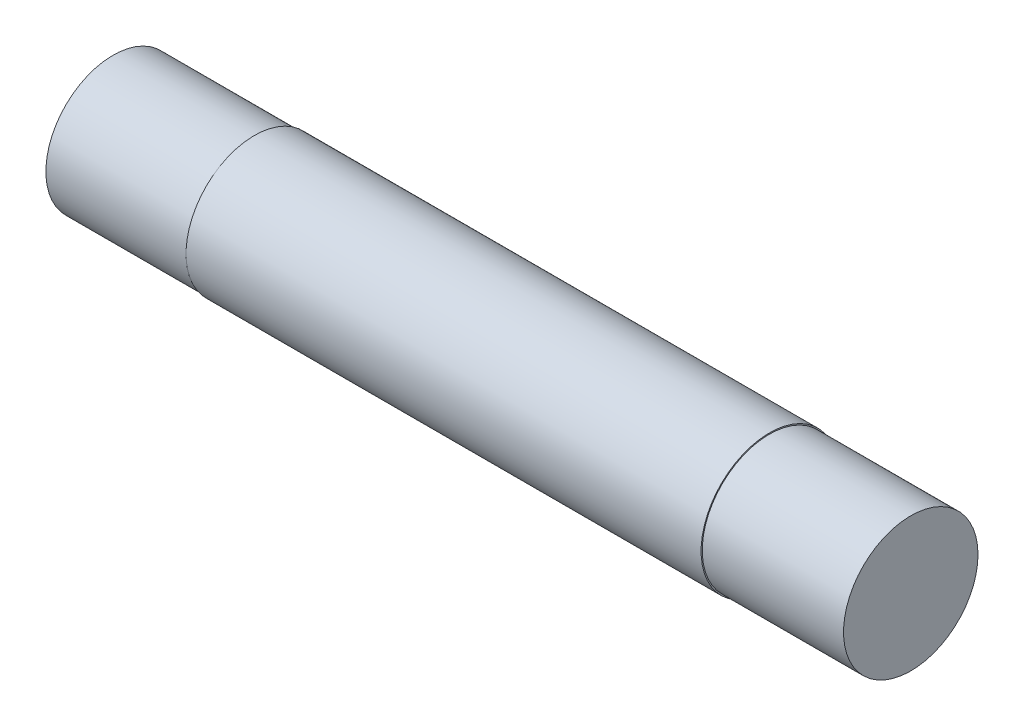
ISO-10303-21;
HEADER;
FILE_DESCRIPTION(('STEP AP214'),'2;1');
FILE_NAME('part.step','',(''),(''),'','','');
FILE_SCHEMA(('AUTOMOTIVE_DESIGN { 1 0 10303 214 1 1 1 1 }'));
ENDSEC;
DATA;
#1=APPLICATION_CONTEXT('core data for automotive mechanical design processes');
#2=APPLICATION_PROTOCOL_DEFINITION('international standard','automotive_design',2000,#1);
#3=PRODUCT_CONTEXT('',#1,'mechanical');
#4=PRODUCT('Part','Part','',(#3));
#5=PRODUCT_RELATED_PRODUCT_CATEGORY('part','',(#4));
#6=PRODUCT_DEFINITION_FORMATION('','',#4);
#7=PRODUCT_DEFINITION_CONTEXT('part definition',#1,'design');
#8=PRODUCT_DEFINITION('design','',#6,#7);
#9=PRODUCT_DEFINITION_SHAPE('','',#8);
#10=(LENGTH_UNIT() NAMED_UNIT(*) SI_UNIT(.MILLI.,.METRE.));
#11=(NAMED_UNIT(*) PLANE_ANGLE_UNIT() SI_UNIT($,.RADIAN.));
#12=(NAMED_UNIT(*) SI_UNIT($,.STERADIAN.) SOLID_ANGLE_UNIT());
#13=UNCERTAINTY_MEASURE_WITH_UNIT(LENGTH_MEASURE(1.E-05),#10,'distance_accuracy_value','');
#14=(GEOMETRIC_REPRESENTATION_CONTEXT(3) GLOBAL_UNCERTAINTY_ASSIGNED_CONTEXT((#13)) GLOBAL_UNIT_ASSIGNED_CONTEXT((#10,
#11,#12)) REPRESENTATION_CONTEXT('',''));
#15=CARTESIAN_POINT('',(0.,0.,0.));
#16=DIRECTION('',(0.,0.,1.));
#17=DIRECTION('',(1.,0.,0.));
#18=AXIS2_PLACEMENT_3D('',#15,#16,#17);
#19=CARTESIAN_POINT('',(22.225,0.,0.));
#20=DIRECTION('',(-1.,0.,0.));
#21=DIRECTION('',(0.,0.,1.));
#22=AXIS2_PLACEMENT_3D('',#19,#20,#21);
#23=CYLINDRICAL_SURFACE('',#22,3.81);
#24=CARTESIAN_POINT('',(-14.351,0.,0.));
#25=DIRECTION('',(1.,0.,0.));
#26=DIRECTION('',(0.,0.,-1.));
#27=AXIS2_PLACEMENT_3D('',#24,#25,#26);
#28=CIRCLE('',#27,3.81);
#29=CARTESIAN_POINT('',(-14.351,0.,-3.81));
#30=VERTEX_POINT('',#29);
#31=EDGE_CURVE('E45',#30,#30,#28,.T.);
#32=ORIENTED_EDGE('',*,*,#31,.T.);
#33=EDGE_LOOP('',(#32));
#34=FACE_BOUND('',#33,.T.);
#35=CARTESIAN_POINT('',(14.351,0.,0.));
#36=DIRECTION('',(1.,0.,0.));
#37=DIRECTION('',(0.,0.,-1.));
#38=AXIS2_PLACEMENT_3D('',#35,#36,#37);
#39=CIRCLE('',#38,3.81);
#40=CARTESIAN_POINT('',(14.351,0.,-3.81));
#41=VERTEX_POINT('',#40);
#42=EDGE_CURVE('E11',#41,#41,#39,.T.);
#43=ORIENTED_EDGE('',*,*,#42,.F.);
#44=EDGE_LOOP('',(#43));
#45=FACE_BOUND('',#44,.T.);
#46=ADVANCED_FACE('F42',(#34,#45),#23,.T.);
#47=CARTESIAN_POINT('',(14.351,0.,0.));
#48=DIRECTION('',(1.,0.,0.));
#49=DIRECTION('',(0.,0.,-1.));
#50=AXIS2_PLACEMENT_3D('',#47,#48,#49);
#51=PLANE('',#50);
#52=CARTESIAN_POINT('',(14.351,0.,0.));
#53=DIRECTION('',(1.,0.,0.));
#54=DIRECTION('',(0.,0.,-1.));
#55=AXIS2_PLACEMENT_3D('',#52,#53,#54);
#56=CIRCLE('',#55,3.7465);
#57=CARTESIAN_POINT('',(14.351,0.,-3.7465));
#58=VERTEX_POINT('',#57);
#59=EDGE_CURVE('E49',#58,#58,#56,.T.);
#60=ORIENTED_EDGE('',*,*,#59,.F.);
#61=EDGE_LOOP('',(#60));
#62=FACE_BOUND('',#61,.T.);
#63=ORIENTED_EDGE('',*,*,#42,.T.);
#64=EDGE_LOOP('',(#63));
#65=FACE_BOUND('',#64,.T.);
#66=ADVANCED_FACE('F87',(#62,#65),#51,.T.);
#67=CARTESIAN_POINT('',(14.351,0.,0.));
#68=DIRECTION('',(1.,0.,0.));
#69=DIRECTION('',(0.,0.,-1.));
#70=AXIS2_PLACEMENT_3D('',#67,#68,#69);
#71=CYLINDRICAL_SURFACE('',#70,3.7465);
#72=ORIENTED_EDGE('',*,*,#59,.T.);
#73=EDGE_LOOP('',(#72));
#74=FACE_BOUND('',#73,.T.);
#75=CARTESIAN_POINT('',(22.225,0.,0.));
#76=DIRECTION('',(1.,0.,0.));
#77=DIRECTION('',(0.,0.,-1.));
#78=AXIS2_PLACEMENT_3D('',#75,#76,#77);
#79=CIRCLE('',#78,3.7465);
#80=CARTESIAN_POINT('',(22.225,0.,-3.7465));
#81=VERTEX_POINT('',#80);
#82=EDGE_CURVE('E53',#81,#81,#79,.T.);
#83=ORIENTED_EDGE('',*,*,#82,.F.);
#84=EDGE_LOOP('',(#83));
#85=FACE_BOUND('',#84,.T.);
#86=ADVANCED_FACE('F82',(#74,#85),#71,.T.);
#87=CARTESIAN_POINT('',(22.225,0.,0.));
#88=DIRECTION('',(1.,0.,0.));
#89=DIRECTION('',(0.,0.,-1.));
#90=AXIS2_PLACEMENT_3D('',#87,#88,#89);
#91=PLANE('',#90);
#92=ORIENTED_EDGE('',*,*,#82,.T.);
#93=EDGE_LOOP('',(#92));
#94=FACE_BOUND('',#93,.T.);
#95=ADVANCED_FACE('F73',(#94),#91,.T.);
#96=CARTESIAN_POINT('',(-14.351,0.,0.));
#97=DIRECTION('',(1.,0.,0.));
#98=DIRECTION('',(0.,0.,-1.));
#99=AXIS2_PLACEMENT_3D('',#96,#97,#98);
#100=PLANE('',#99);
#101=CARTESIAN_POINT('',(-14.351,0.,0.));
#102=DIRECTION('',(1.,0.,0.));
#103=DIRECTION('',(0.,0.,-1.));
#104=AXIS2_PLACEMENT_3D('',#101,#102,#103);
#105=CIRCLE('',#104,3.7465);
#106=CARTESIAN_POINT('',(-14.351,0.,-3.7465));
#107=VERTEX_POINT('',#106);
#108=EDGE_CURVE('E61',#107,#107,#105,.T.);
#109=ORIENTED_EDGE('',*,*,#108,.T.);
#110=EDGE_LOOP('',(#109));
#111=FACE_BOUND('',#110,.T.);
#112=ORIENTED_EDGE('',*,*,#31,.F.);
#113=EDGE_LOOP('',(#112));
#114=FACE_BOUND('',#113,.T.);
#115=ADVANCED_FACE('F70',(#111,#114),#100,.F.);
#116=CARTESIAN_POINT('',(-14.351,0.,0.));
#117=DIRECTION('',(-1.,0.,0.));
#118=DIRECTION('',(0.,0.,1.));
#119=AXIS2_PLACEMENT_3D('',#116,#117,#118);
#120=CYLINDRICAL_SURFACE('',#119,3.7465);
#121=ORIENTED_EDGE('',*,*,#108,.F.);
#122=EDGE_LOOP('',(#121));
#123=FACE_BOUND('',#122,.T.);
#124=CARTESIAN_POINT('',(-22.225,0.,0.));
#125=DIRECTION('',(1.,0.,0.));
#126=DIRECTION('',(0.,0.,-1.));
#127=AXIS2_PLACEMENT_3D('',#124,#125,#126);
#128=CIRCLE('',#127,3.7465);
#129=CARTESIAN_POINT('',(-22.225,0.,-3.7465));
#130=VERTEX_POINT('',#129);
#131=EDGE_CURVE('E58',#130,#130,#128,.T.);
#132=ORIENTED_EDGE('',*,*,#131,.T.);
#133=EDGE_LOOP('',(#132));
#134=FACE_BOUND('',#133,.T.);
#135=ADVANCED_FACE('F72',(#123,#134),#120,.T.);
#136=CARTESIAN_POINT('',(-22.225,0.,0.));
#137=DIRECTION('',(1.,0.,0.));
#138=DIRECTION('',(0.,0.,-1.));
#139=AXIS2_PLACEMENT_3D('',#136,#137,#138);
#140=PLANE('',#139);
#141=ORIENTED_EDGE('',*,*,#131,.F.);
#142=EDGE_LOOP('',(#141));
#143=FACE_BOUND('',#142,.T.);
#144=ADVANCED_FACE('F79',(#143),#140,.F.);
#145=CLOSED_SHELL('',(#46,#66,#86,#95,#115,#135,#144));
#146=MANIFOLD_SOLID_BREP('B2',#145);
#147=ADVANCED_BREP_SHAPE_REPRESENTATION('',(#18,#146),#14);
#148=SHAPE_DEFINITION_REPRESENTATION(#9,#147);
ENDSEC;
END-ISO-10303-21;
